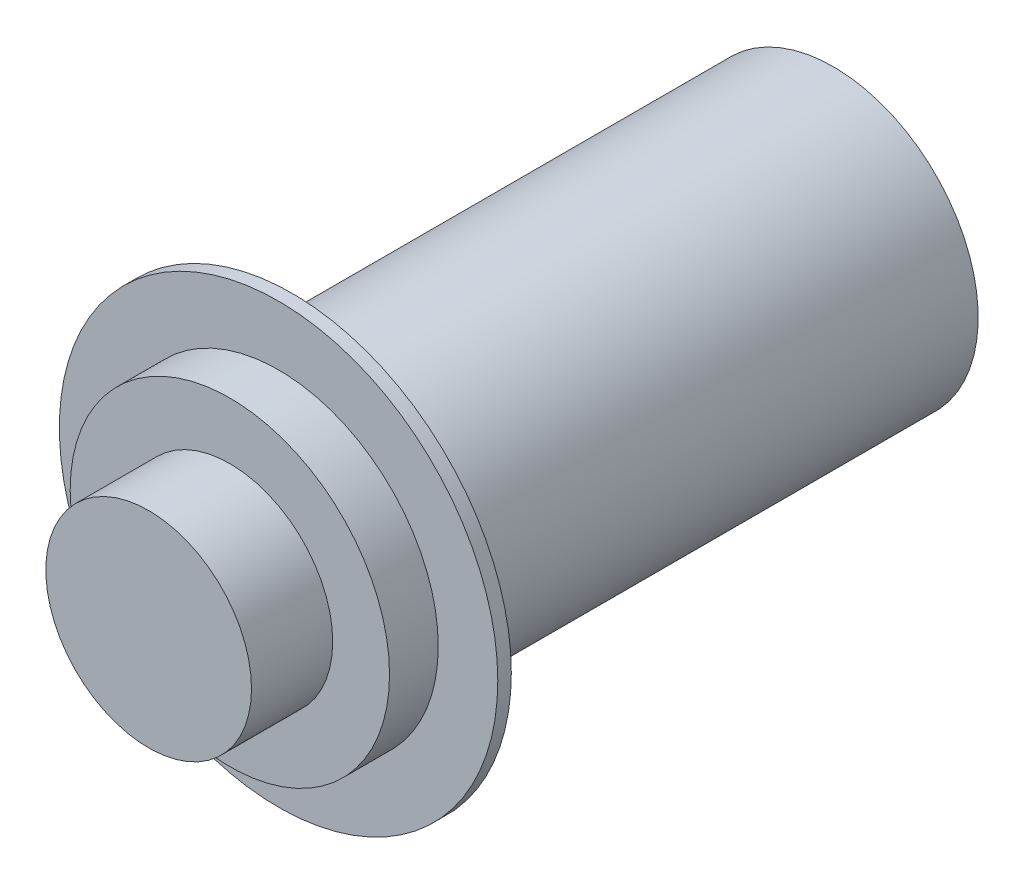
ISO-10303-21;
HEADER;
FILE_DESCRIPTION(('STEP AP214'),'2;1');
FILE_NAME('part.step','',(''),(''),'','','');
FILE_SCHEMA(('AUTOMOTIVE_DESIGN { 1 0 10303 214 1 1 1 1 }'));
ENDSEC;
DATA;
#1=APPLICATION_CONTEXT('core data for automotive mechanical design processes');
#2=APPLICATION_PROTOCOL_DEFINITION('international standard','automotive_design',2000,#1);
#3=PRODUCT_CONTEXT('',#1,'mechanical');
#4=PRODUCT('Part','Part','',(#3));
#5=PRODUCT_RELATED_PRODUCT_CATEGORY('part','',(#4));
#6=PRODUCT_DEFINITION_FORMATION('','',#4);
#7=PRODUCT_DEFINITION_CONTEXT('part definition',#1,'design');
#8=PRODUCT_DEFINITION('design','',#6,#7);
#9=PRODUCT_DEFINITION_SHAPE('','',#8);
#10=(LENGTH_UNIT() NAMED_UNIT(*) SI_UNIT(.MILLI.,.METRE.));
#11=(NAMED_UNIT(*) PLANE_ANGLE_UNIT() SI_UNIT($,.RADIAN.));
#12=(NAMED_UNIT(*) SI_UNIT($,.STERADIAN.) SOLID_ANGLE_UNIT());
#13=UNCERTAINTY_MEASURE_WITH_UNIT(LENGTH_MEASURE(1.E-05),#10,'distance_accuracy_value','');
#14=(GEOMETRIC_REPRESENTATION_CONTEXT(3) GLOBAL_UNCERTAINTY_ASSIGNED_CONTEXT((#13)) GLOBAL_UNIT_ASSIGNED_CONTEXT((#10,
#11,#12)) REPRESENTATION_CONTEXT('',''));
#15=CARTESIAN_POINT('',(0.,0.,0.));
#16=DIRECTION('',(0.,0.,1.));
#17=DIRECTION('',(1.,0.,0.));
#18=AXIS2_PLACEMENT_3D('',#15,#16,#17);
#19=CARTESIAN_POINT('',(0.,0.,0.5));
#20=DIRECTION('',(0.,0.,-1.));
#21=DIRECTION('',(-1.,0.,0.));
#22=AXIS2_PLACEMENT_3D('',#19,#20,#21);
#23=CYLINDRICAL_SURFACE('',#22,8.1);
#24=CARTESIAN_POINT('',(0.,0.,0.5));
#25=DIRECTION('',(0.,0.,1.));
#26=DIRECTION('',(1.,0.,0.));
#27=AXIS2_PLACEMENT_3D('',#24,#25,#26);
#28=CIRCLE('',#27,8.1);
#29=CARTESIAN_POINT('',(8.1,0.,0.5));
#30=VERTEX_POINT('',#29);
#31=EDGE_CURVE('E57',#30,#30,#28,.T.);
#32=ORIENTED_EDGE('',*,*,#31,.F.);
#33=EDGE_LOOP('',(#32));
#34=FACE_BOUND('',#33,.T.);
#35=CARTESIAN_POINT('',(0.,0.,0.));
#36=DIRECTION('',(0.,0.,1.));
#37=DIRECTION('',(1.,0.,0.));
#38=AXIS2_PLACEMENT_3D('',#35,#36,#37);
#39=CIRCLE('',#38,8.1);
#40=CARTESIAN_POINT('',(8.1,0.,0.));
#41=VERTEX_POINT('',#40);
#42=EDGE_CURVE('E36',#41,#41,#39,.T.);
#43=ORIENTED_EDGE('',*,*,#42,.T.);
#44=EDGE_LOOP('',(#43));
#45=FACE_BOUND('',#44,.T.);
#46=ADVANCED_FACE('F33',(#34,#45),#23,.T.);
#47=CARTESIAN_POINT('',(0.,0.,0.5));
#48=DIRECTION('',(0.,0.,1.));
#49=DIRECTION('',(1.,0.,0.));
#50=AXIS2_PLACEMENT_3D('',#47,#48,#49);
#51=PLANE('',#50);
#52=CARTESIAN_POINT('',(0.,0.,0.5));
#53=DIRECTION('',(0.,0.,1.));
#54=DIRECTION('',(1.,0.,0.));
#55=AXIS2_PLACEMENT_3D('',#52,#53,#54);
#56=CIRCLE('',#55,5.9);
#57=CARTESIAN_POINT('',(5.9,0.,0.5));
#58=VERTEX_POINT('',#57);
#59=EDGE_CURVE('E45',#58,#58,#56,.T.);
#60=ORIENTED_EDGE('',*,*,#59,.F.);
#61=EDGE_LOOP('',(#60));
#62=FACE_BOUND('',#61,.T.);
#63=ORIENTED_EDGE('',*,*,#31,.T.);
#64=EDGE_LOOP('',(#63));
#65=FACE_BOUND('',#64,.T.);
#66=ADVANCED_FACE('F68',(#62,#65),#51,.T.);
#67=CARTESIAN_POINT('',(0.,0.,0.));
#68=DIRECTION('',(0.,0.,1.));
#69=DIRECTION('',(1.,0.,0.));
#70=AXIS2_PLACEMENT_3D('',#67,#68,#69);
#71=PLANE('',#70);
#72=CARTESIAN_POINT('',(0.,0.,0.));
#73=DIRECTION('',(0.,0.,-1.));
#74=DIRECTION('',(-1.,0.,0.));
#75=AXIS2_PLACEMENT_3D('',#72,#73,#74);
#76=CIRCLE('',#75,5.35);
#77=CARTESIAN_POINT('',(-5.35,0.,0.));
#78=VERTEX_POINT('',#77);
#79=EDGE_CURVE('E10',#78,#78,#76,.T.);
#80=ORIENTED_EDGE('',*,*,#79,.F.);
#81=EDGE_LOOP('',(#80));
#82=FACE_BOUND('',#81,.T.);
#83=ORIENTED_EDGE('',*,*,#42,.F.);
#84=EDGE_LOOP('',(#83));
#85=FACE_BOUND('',#84,.T.);
#86=ADVANCED_FACE('F65',(#82,#85),#71,.F.);
#87=CARTESIAN_POINT('',(0.,0.,2.3));
#88=DIRECTION('',(0.,0.,-1.));
#89=DIRECTION('',(-1.,0.,0.));
#90=AXIS2_PLACEMENT_3D('',#87,#88,#89);
#91=CYLINDRICAL_SURFACE('',#90,5.9);
#92=CARTESIAN_POINT('',(0.,0.,2.3));
#93=DIRECTION('',(0.,0.,1.));
#94=DIRECTION('',(1.,0.,0.));
#95=AXIS2_PLACEMENT_3D('',#92,#93,#94);
#96=CIRCLE('',#95,5.9);
#97=CARTESIAN_POINT('',(5.9,0.,2.3));
#98=VERTEX_POINT('',#97);
#99=EDGE_CURVE('E52',#98,#98,#96,.T.);
#100=ORIENTED_EDGE('',*,*,#99,.F.);
#101=EDGE_LOOP('',(#100));
#102=FACE_BOUND('',#101,.T.);
#103=ORIENTED_EDGE('',*,*,#59,.T.);
#104=EDGE_LOOP('',(#103));
#105=FACE_BOUND('',#104,.T.);
#106=ADVANCED_FACE('F67',(#102,#105),#91,.T.);
#107=CARTESIAN_POINT('',(0.,0.,2.3));
#108=DIRECTION('',(0.,0.,1.));
#109=DIRECTION('',(1.,0.,0.));
#110=AXIS2_PLACEMENT_3D('',#107,#108,#109);
#111=PLANE('',#110);
#112=CARTESIAN_POINT('',(0.,0.,2.3));
#113=DIRECTION('',(0.,0.,1.));
#114=DIRECTION('',(1.,0.,0.));
#115=AXIS2_PLACEMENT_3D('',#112,#113,#114);
#116=CIRCLE('',#115,3.8);
#117=CARTESIAN_POINT('',(3.8,0.,2.3));
#118=VERTEX_POINT('',#117);
#119=EDGE_CURVE('E40',#118,#118,#116,.T.);
#120=ORIENTED_EDGE('',*,*,#119,.F.);
#121=EDGE_LOOP('',(#120));
#122=FACE_BOUND('',#121,.T.);
#123=ORIENTED_EDGE('',*,*,#99,.T.);
#124=EDGE_LOOP('',(#123));
#125=FACE_BOUND('',#124,.T.);
#126=ADVANCED_FACE('F74',(#122,#125),#111,.T.);
#127=CARTESIAN_POINT('',(0.,0.,5.3));
#128=DIRECTION('',(0.,0.,-1.));
#129=DIRECTION('',(-1.,0.,0.));
#130=AXIS2_PLACEMENT_3D('',#127,#128,#129);
#131=CYLINDRICAL_SURFACE('',#130,3.8);
#132=CARTESIAN_POINT('',(0.,0.,5.3));
#133=DIRECTION('',(0.,0.,1.));
#134=DIRECTION('',(1.,0.,0.));
#135=AXIS2_PLACEMENT_3D('',#132,#133,#134);
#136=CIRCLE('',#135,3.8);
#137=CARTESIAN_POINT('',(3.8,0.,5.3));
#138=VERTEX_POINT('',#137);
#139=EDGE_CURVE('E50',#138,#138,#136,.T.);
#140=ORIENTED_EDGE('',*,*,#139,.F.);
#141=EDGE_LOOP('',(#140));
#142=FACE_BOUND('',#141,.T.);
#143=ORIENTED_EDGE('',*,*,#119,.T.);
#144=EDGE_LOOP('',(#143));
#145=FACE_BOUND('',#144,.T.);
#146=ADVANCED_FACE('F99',(#142,#145),#131,.T.);
#147=CARTESIAN_POINT('',(0.,0.,5.3));
#148=DIRECTION('',(0.,0.,1.));
#149=DIRECTION('',(1.,0.,0.));
#150=AXIS2_PLACEMENT_3D('',#147,#148,#149);
#151=PLANE('',#150);
#152=ORIENTED_EDGE('',*,*,#139,.T.);
#153=EDGE_LOOP('',(#152));
#154=FACE_BOUND('',#153,.T.);
#155=ADVANCED_FACE('F111',(#154),#151,.T.);
#156=CARTESIAN_POINT('',(0.,0.,-20.));
#157=DIRECTION('',(0.,0.,1.));
#158=DIRECTION('',(1.,0.,0.));
#159=AXIS2_PLACEMENT_3D('',#156,#157,#158);
#160=CYLINDRICAL_SURFACE('',#159,5.35);
#161=CARTESIAN_POINT('',(0.,0.,-20.));
#162=DIRECTION('',(0.,0.,-1.));
#163=DIRECTION('',(-1.,0.,0.));
#164=AXIS2_PLACEMENT_3D('',#161,#162,#163);
#165=CIRCLE('',#164,5.35);
#166=CARTESIAN_POINT('',(-5.35,0.,-20.));
#167=VERTEX_POINT('',#166);
#168=EDGE_CURVE('E49',#167,#167,#165,.T.);
#169=ORIENTED_EDGE('',*,*,#168,.F.);
#170=EDGE_LOOP('',(#169));
#171=FACE_BOUND('',#170,.T.);
#172=ORIENTED_EDGE('',*,*,#79,.T.);
#173=EDGE_LOOP('',(#172));
#174=FACE_BOUND('',#173,.T.);
#175=ADVANCED_FACE('F117',(#171,#174),#160,.T.);
#176=CARTESIAN_POINT('',(0.,0.,-20.));
#177=DIRECTION('',(0.,0.,-1.));
#178=DIRECTION('',(-1.,0.,0.));
#179=AXIS2_PLACEMENT_3D('',#176,#177,#178);
#180=PLANE('',#179);
#181=ORIENTED_EDGE('',*,*,#168,.T.);
#182=EDGE_LOOP('',(#181));
#183=FACE_BOUND('',#182,.T.);
#184=ADVANCED_FACE('F125',(#183),#180,.T.);
#185=CLOSED_SHELL('',(#46,#66,#86,#106,#126,#146,#155,#175,#184));
#186=MANIFOLD_SOLID_BREP('B2',#185);
#187=ADVANCED_BREP_SHAPE_REPRESENTATION('',(#18,#186),#14);
#188=SHAPE_DEFINITION_REPRESENTATION(#9,#187);
ENDSEC;
END-ISO-10303-21;
